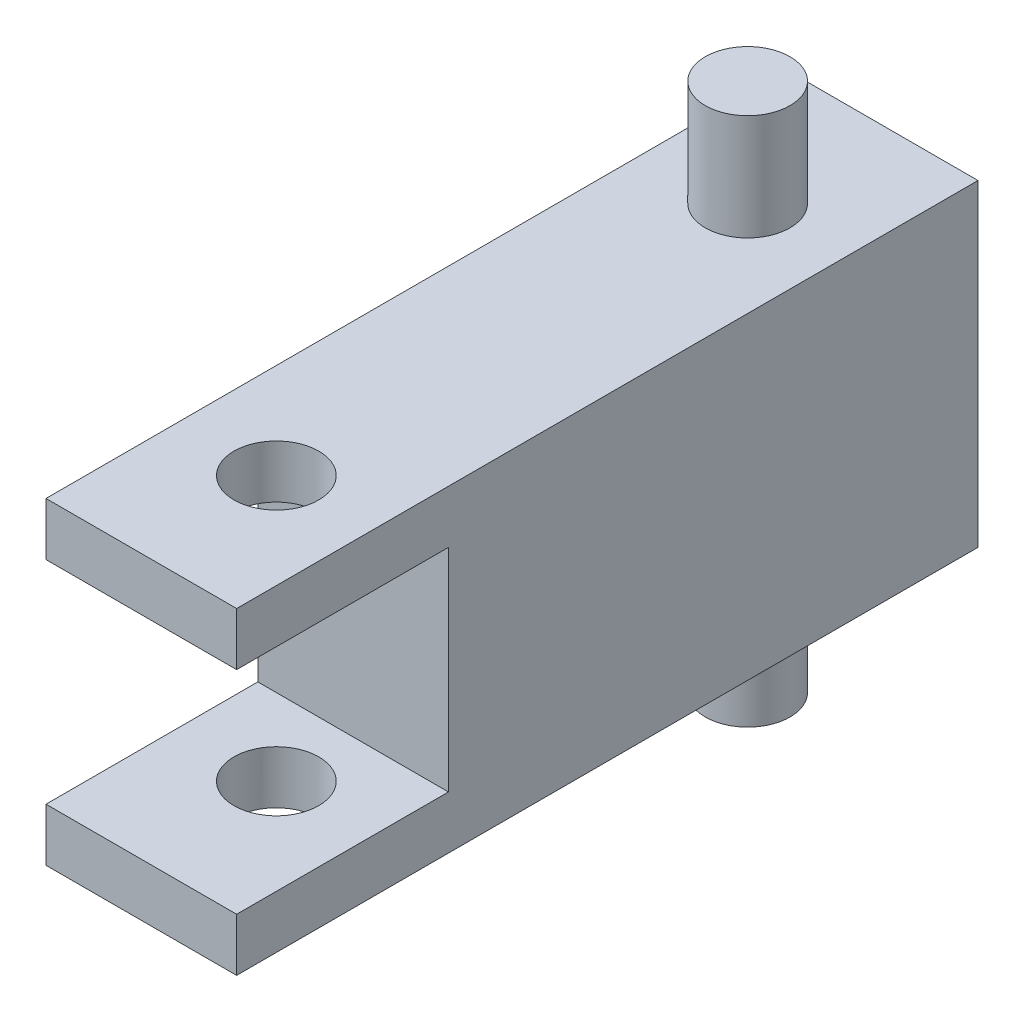
ISO-10303-21;
HEADER;
FILE_DESCRIPTION(('STEP AP214'),'2;1');
FILE_NAME('part.step','',(''),(''),'','','');
FILE_SCHEMA(('AUTOMOTIVE_DESIGN { 1 0 10303 214 1 1 1 1 }'));
ENDSEC;
DATA;
#1=APPLICATION_CONTEXT('core data for automotive mechanical design processes');
#2=APPLICATION_PROTOCOL_DEFINITION('international standard','automotive_design',2000,#1);
#3=PRODUCT_CONTEXT('',#1,'mechanical');
#4=PRODUCT('Part','Part','',(#3));
#5=PRODUCT_RELATED_PRODUCT_CATEGORY('part','',(#4));
#6=PRODUCT_DEFINITION_FORMATION('','',#4);
#7=PRODUCT_DEFINITION_CONTEXT('part definition',#1,'design');
#8=PRODUCT_DEFINITION('design','',#6,#7);
#9=PRODUCT_DEFINITION_SHAPE('','',#8);
#10=(LENGTH_UNIT() NAMED_UNIT(*) SI_UNIT(.MILLI.,.METRE.));
#11=(NAMED_UNIT(*) PLANE_ANGLE_UNIT() SI_UNIT($,.RADIAN.));
#12=(NAMED_UNIT(*) SI_UNIT($,.STERADIAN.) SOLID_ANGLE_UNIT());
#13=UNCERTAINTY_MEASURE_WITH_UNIT(LENGTH_MEASURE(1.E-05),#10,'distance_accuracy_value','');
#14=(GEOMETRIC_REPRESENTATION_CONTEXT(3) GLOBAL_UNCERTAINTY_ASSIGNED_CONTEXT((#13)) GLOBAL_UNIT_ASSIGNED_CONTEXT((#10,
#11,#12)) REPRESENTATION_CONTEXT('',''));
#15=CARTESIAN_POINT('',(0.,0.,0.));
#16=DIRECTION('',(0.,0.,1.));
#17=DIRECTION('',(1.,0.,0.));
#18=AXIS2_PLACEMENT_3D('',#15,#16,#17);
#19=CARTESIAN_POINT('',(0.,0.,70.));
#20=DIRECTION('',(0.,0.,1.));
#21=DIRECTION('',(1.,0.,0.));
#22=AXIS2_PLACEMENT_3D('',#19,#20,#21);
#23=PLANE('',#22);
#24=DIRECTION('',(1.,0.,0.));
#25=VECTOR('',#24,1.);
#26=CARTESIAN_POINT('',(-43.,9.99999999999999,70.));
#27=LINE('',#26,#25);
#28=CARTESIAN_POINT('',(-9.00000000000001,9.99999999999999,70.));
#29=VERTEX_POINT('',#28);
#30=CARTESIAN_POINT('',(9.,10.,70.));
#31=VERTEX_POINT('',#30);
#32=EDGE_CURVE('E163',#29,#31,#27,.T.);
#33=ORIENTED_EDGE('',*,*,#32,.T.);
#34=DIRECTION('',(0.,1.,0.));
#35=VECTOR('',#34,1.);
#36=CARTESIAN_POINT('',(9.,15.,70.));
#37=LINE('',#36,#35);
#38=CARTESIAN_POINT('',(9.,15.,70.));
#39=VERTEX_POINT('',#38);
#40=EDGE_CURVE('E90',#31,#39,#37,.T.);
#41=ORIENTED_EDGE('',*,*,#40,.T.);
#42=DIRECTION('',(-1.,0.,0.));
#43=VECTOR('',#42,1.);
#44=CARTESIAN_POINT('',(-9.,15.,70.));
#45=LINE('',#44,#43);
#46=CARTESIAN_POINT('',(-9.,15.,70.));
#47=VERTEX_POINT('',#46);
#48=EDGE_CURVE('E129',#39,#47,#45,.T.);
#49=ORIENTED_EDGE('',*,*,#48,.T.);
#50=DIRECTION('',(0.,-1.,0.));
#51=VECTOR('',#50,1.);
#52=CARTESIAN_POINT('',(-9.,15.,70.));
#53=LINE('',#52,#51);
#54=EDGE_CURVE('E137',#47,#29,#53,.T.);
#55=ORIENTED_EDGE('',*,*,#54,.T.);
#56=EDGE_LOOP('',(#33,#41,#49,#55));
#57=FACE_BOUND('',#56,.T.);
#58=ADVANCED_FACE('F37',(#57),#23,.T.);
#59=CARTESIAN_POINT('',(0.,-27.,57.25));
#60=DIRECTION('',(0.,1.,0.));
#61=DIRECTION('',(0.,0.,1.));
#62=AXIS2_PLACEMENT_3D('',#59,#60,#61);
#63=CYLINDRICAL_SURFACE('',#62,4.);
#64=CARTESIAN_POINT('',(0.,9.99999999999999,57.25));
#65=DIRECTION('',(0.,1.,0.));
#66=DIRECTION('',(0.,0.,1.));
#67=AXIS2_PLACEMENT_3D('',#64,#65,#66);
#68=CIRCLE('',#67,4.);
#69=CARTESIAN_POINT('',(0.,9.99999999999999,61.25));
#70=VERTEX_POINT('',#69);
#71=EDGE_CURVE('E164',#70,#70,#68,.F.);
#72=ORIENTED_EDGE('',*,*,#71,.T.);
#73=EDGE_LOOP('',(#72));
#74=FACE_BOUND('',#73,.T.);
#75=CARTESIAN_POINT('',(0.,15.,57.25));
#76=DIRECTION('',(0.,-1.,0.));
#77=DIRECTION('',(0.,0.,-1.));
#78=AXIS2_PLACEMENT_3D('',#75,#76,#77);
#79=CIRCLE('',#78,4.);
#80=CARTESIAN_POINT('',(0.,15.,53.25));
#81=VERTEX_POINT('',#80);
#82=EDGE_CURVE('E178',#81,#81,#79,.T.);
#83=ORIENTED_EDGE('',*,*,#82,.F.);
#84=EDGE_LOOP('',(#83));
#85=FACE_BOUND('',#84,.T.);
#86=ADVANCED_FACE('F206',(#74,#85),#63,.F.);
#87=CARTESIAN_POINT('',(9.,15.,70.));
#88=DIRECTION('',(-1.,0.,0.));
#89=DIRECTION('',(0.,-1.,0.));
#90=AXIS2_PLACEMENT_3D('',#87,#88,#89);
#91=PLANE('',#90);
#92=ORIENTED_EDGE('',*,*,#40,.F.);
#93=DIRECTION('',(0.,0.,1.));
#94=VECTOR('',#93,1.);
#95=CARTESIAN_POINT('',(9.,10.,50.));
#96=LINE('',#95,#94);
#97=CARTESIAN_POINT('',(9.,10.,50.));
#98=VERTEX_POINT('',#97);
#99=EDGE_CURVE('E119',#98,#31,#96,.T.);
#100=ORIENTED_EDGE('',*,*,#99,.F.);
#101=DIRECTION('',(0.,1.,0.));
#102=VECTOR('',#101,1.);
#103=CARTESIAN_POINT('',(9.,-9.99999999999999,50.));
#104=LINE('',#103,#102);
#105=CARTESIAN_POINT('',(9.,-9.99999999999999,50.));
#106=VERTEX_POINT('',#105);
#107=EDGE_CURVE('E126',#106,#98,#104,.T.);
#108=ORIENTED_EDGE('',*,*,#107,.F.);
#109=DIRECTION('',(0.,0.,-1.));
#110=VECTOR('',#109,1.);
#111=CARTESIAN_POINT('',(9.,-9.99999999999999,50.));
#112=LINE('',#111,#110);
#113=CARTESIAN_POINT('',(9.,-10.,70.));
#114=VERTEX_POINT('',#113);
#115=EDGE_CURVE('E115',#114,#106,#112,.T.);
#116=ORIENTED_EDGE('',*,*,#115,.F.);
#117=CARTESIAN_POINT('',(9.,-15.,70.));
#118=VERTEX_POINT('',#117);
#119=EDGE_CURVE('E123',#118,#114,#37,.T.);
#120=ORIENTED_EDGE('',*,*,#119,.F.);
#121=DIRECTION('',(0.,0.,-1.));
#122=VECTOR('',#121,1.);
#123=CARTESIAN_POINT('',(9.,-15.,70.));
#124=LINE('',#123,#122);
#125=CARTESIAN_POINT('',(9.,-15.,0.));
#126=VERTEX_POINT('',#125);
#127=EDGE_CURVE('E141',#118,#126,#124,.T.);
#128=ORIENTED_EDGE('',*,*,#127,.T.);
#129=DIRECTION('',(0.,1.,0.));
#130=VECTOR('',#129,1.);
#131=CARTESIAN_POINT('',(9.,15.,0.));
#132=LINE('',#131,#130);
#133=CARTESIAN_POINT('',(9.,15.,0.));
#134=VERTEX_POINT('',#133);
#135=EDGE_CURVE('E142',#126,#134,#132,.T.);
#136=ORIENTED_EDGE('',*,*,#135,.T.);
#137=DIRECTION('',(0.,0.,-1.));
#138=VECTOR('',#137,1.);
#139=CARTESIAN_POINT('',(9.,15.,70.));
#140=LINE('',#139,#138);
#141=EDGE_CURVE('E156',#39,#134,#140,.T.);
#142=ORIENTED_EDGE('',*,*,#141,.F.);
#143=EDGE_LOOP('',(#92,#100,#108,#116,#120,#128,#136,#142));
#144=FACE_BOUND('',#143,.T.);
#145=ADVANCED_FACE('F39',(#144),#91,.F.);
#146=CARTESIAN_POINT('',(-9.,15.,70.));
#147=DIRECTION('',(0.,-1.,0.));
#148=DIRECTION('',(0.,0.,-1.));
#149=AXIS2_PLACEMENT_3D('',#146,#147,#148);
#150=PLANE('',#149);
#151=ORIENTED_EDGE('',*,*,#82,.T.);
#152=EDGE_LOOP('',(#151));
#153=FACE_BOUND('',#152,.T.);
#154=CARTESIAN_POINT('',(0.,15.,12.75));
#155=DIRECTION('',(0.,-1.,0.));
#156=DIRECTION('',(0.,0.,-1.));
#157=AXIS2_PLACEMENT_3D('',#154,#155,#156);
#158=CIRCLE('',#157,4.);
#159=CARTESIAN_POINT('',(0.,15.,8.75));
#160=VERTEX_POINT('',#159);
#161=EDGE_CURVE('E45',#160,#160,#158,.F.);
#162=ORIENTED_EDGE('',*,*,#161,.F.);
#163=EDGE_LOOP('',(#162));
#164=FACE_BOUND('',#163,.T.);
#165=DIRECTION('',(-1.,0.,0.));
#166=VECTOR('',#165,1.);
#167=CARTESIAN_POINT('',(-9.,15.,0.));
#168=LINE('',#167,#166);
#169=CARTESIAN_POINT('',(-9.,15.,0.));
#170=VERTEX_POINT('',#169);
#171=EDGE_CURVE('E145',#134,#170,#168,.T.);
#172=ORIENTED_EDGE('',*,*,#171,.T.);
#173=DIRECTION('',(0.,0.,-1.));
#174=VECTOR('',#173,1.);
#175=CARTESIAN_POINT('',(-9.,15.,70.));
#176=LINE('',#175,#174);
#177=EDGE_CURVE('E153',#47,#170,#176,.T.);
#178=ORIENTED_EDGE('',*,*,#177,.F.);
#179=ORIENTED_EDGE('',*,*,#48,.F.);
#180=ORIENTED_EDGE('',*,*,#141,.T.);
#181=EDGE_LOOP('',(#172,#178,#179,#180));
#182=FACE_BOUND('',#181,.T.);
#183=ADVANCED_FACE('F227',(#153,#164,#182),#150,.F.);
#184=CARTESIAN_POINT('',(-9.,15.,70.));
#185=DIRECTION('',(1.,0.,0.));
#186=DIRECTION('',(0.,1.,0.));
#187=AXIS2_PLACEMENT_3D('',#184,#185,#186);
#188=PLANE('',#187);
#189=DIRECTION('',(0.,1.,0.));
#190=VECTOR('',#189,1.);
#191=CARTESIAN_POINT('',(-9.,15.,50.));
#192=LINE('',#191,#190);
#193=CARTESIAN_POINT('',(-9.00000000000001,-10.,50.));
#194=VERTEX_POINT('',#193);
#195=CARTESIAN_POINT('',(-9.00000000000001,10.,50.));
#196=VERTEX_POINT('',#195);
#197=EDGE_CURVE('E11',#194,#196,#192,.T.);
#198=ORIENTED_EDGE('',*,*,#197,.T.);
#199=DIRECTION('',(0.,0.,1.));
#200=VECTOR('',#199,1.);
#201=CARTESIAN_POINT('',(-9.,9.99999999999999,70.));
#202=LINE('',#201,#200);
#203=EDGE_CURVE('E166',#196,#29,#202,.T.);
#204=ORIENTED_EDGE('',*,*,#203,.T.);
#205=ORIENTED_EDGE('',*,*,#54,.F.);
#206=ORIENTED_EDGE('',*,*,#177,.T.);
#207=DIRECTION('',(0.,-1.,0.));
#208=VECTOR('',#207,1.);
#209=CARTESIAN_POINT('',(-9.,15.,0.));
#210=LINE('',#209,#208);
#211=CARTESIAN_POINT('',(-9.,-15.,0.));
#212=VERTEX_POINT('',#211);
#213=EDGE_CURVE('E147',#170,#212,#210,.T.);
#214=ORIENTED_EDGE('',*,*,#213,.T.);
#215=DIRECTION('',(0.,0.,-1.));
#216=VECTOR('',#215,1.);
#217=CARTESIAN_POINT('',(-9.,-15.,70.));
#218=LINE('',#217,#216);
#219=CARTESIAN_POINT('',(-9.,-15.,70.));
#220=VERTEX_POINT('',#219);
#221=EDGE_CURVE('E151',#220,#212,#218,.T.);
#222=ORIENTED_EDGE('',*,*,#221,.F.);
#223=CARTESIAN_POINT('',(-9.,-9.99999999999999,70.));
#224=VERTEX_POINT('',#223);
#225=EDGE_CURVE('E131',#224,#220,#53,.T.);
#226=ORIENTED_EDGE('',*,*,#225,.F.);
#227=DIRECTION('',(0.,0.,-1.));
#228=VECTOR('',#227,1.);
#229=CARTESIAN_POINT('',(-9.,-10.,70.));
#230=LINE('',#229,#228);
#231=EDGE_CURVE('E52',#224,#194,#230,.T.);
#232=ORIENTED_EDGE('',*,*,#231,.T.);
#233=EDGE_LOOP('',(#198,#204,#205,#206,#214,#222,#226,#232));
#234=FACE_BOUND('',#233,.T.);
#235=ADVANCED_FACE('F221',(#234),#188,.F.);
#236=CARTESIAN_POINT('',(-9.,-15.,70.));
#237=DIRECTION('',(0.,1.,0.));
#238=DIRECTION('',(0.,0.,1.));
#239=AXIS2_PLACEMENT_3D('',#236,#237,#238);
#240=PLANE('',#239);
#241=CARTESIAN_POINT('',(0.,-15.,57.25));
#242=DIRECTION('',(0.,1.,0.));
#243=DIRECTION('',(0.,0.,1.));
#244=AXIS2_PLACEMENT_3D('',#241,#242,#243);
#245=CIRCLE('',#244,4.);
#246=CARTESIAN_POINT('',(0.,-15.,61.25));
#247=VERTEX_POINT('',#246);
#248=EDGE_CURVE('E170',#247,#247,#245,.T.);
#249=ORIENTED_EDGE('',*,*,#248,.T.);
#250=EDGE_LOOP('',(#249));
#251=FACE_BOUND('',#250,.T.);
#252=CARTESIAN_POINT('',(0.,-15.,12.75));
#253=DIRECTION('',(0.,1.,0.));
#254=DIRECTION('',(0.,0.,1.));
#255=AXIS2_PLACEMENT_3D('',#252,#253,#254);
#256=CIRCLE('',#255,4.);
#257=CARTESIAN_POINT('',(0.,-15.,16.75));
#258=VERTEX_POINT('',#257);
#259=EDGE_CURVE('E181',#258,#258,#256,.T.);
#260=ORIENTED_EDGE('',*,*,#259,.T.);
#261=EDGE_LOOP('',(#260));
#262=FACE_BOUND('',#261,.T.);
#263=DIRECTION('',(1.,0.,0.));
#264=VECTOR('',#263,1.);
#265=CARTESIAN_POINT('',(-9.,-15.,0.));
#266=LINE('',#265,#264);
#267=EDGE_CURVE('E82',#212,#126,#266,.T.);
#268=ORIENTED_EDGE('',*,*,#267,.T.);
#269=ORIENTED_EDGE('',*,*,#127,.F.);
#270=DIRECTION('',(1.,0.,0.));
#271=VECTOR('',#270,1.);
#272=CARTESIAN_POINT('',(-9.,-15.,70.));
#273=LINE('',#272,#271);
#274=EDGE_CURVE('E61',#220,#118,#273,.T.);
#275=ORIENTED_EDGE('',*,*,#274,.F.);
#276=ORIENTED_EDGE('',*,*,#221,.T.);
#277=EDGE_LOOP('',(#268,#269,#275,#276));
#278=FACE_BOUND('',#277,.T.);
#279=ADVANCED_FACE('F187',(#251,#262,#278),#240,.F.);
#280=DIRECTION('',(1.,0.,0.));
#281=VECTOR('',#280,1.);
#282=CARTESIAN_POINT('',(-43.,-10.,70.));
#283=LINE('',#282,#281);
#284=EDGE_CURVE('E112',#224,#114,#283,.T.);
#285=ORIENTED_EDGE('',*,*,#284,.F.);
#286=ORIENTED_EDGE('',*,*,#225,.T.);
#287=ORIENTED_EDGE('',*,*,#274,.T.);
#288=ORIENTED_EDGE('',*,*,#119,.T.);
#289=EDGE_LOOP('',(#285,#286,#287,#288));
#290=FACE_BOUND('',#289,.T.);
#291=ADVANCED_FACE('F128',(#290),#23,.T.);
#292=CARTESIAN_POINT('',(0.,0.,0.));
#293=DIRECTION('',(0.,0.,1.));
#294=DIRECTION('',(1.,0.,0.));
#295=AXIS2_PLACEMENT_3D('',#292,#293,#294);
#296=PLANE('',#295);
#297=ORIENTED_EDGE('',*,*,#135,.F.);
#298=ORIENTED_EDGE('',*,*,#267,.F.);
#299=ORIENTED_EDGE('',*,*,#213,.F.);
#300=ORIENTED_EDGE('',*,*,#171,.F.);
#301=EDGE_LOOP('',(#297,#298,#299,#300));
#302=FACE_BOUND('',#301,.T.);
#303=ADVANCED_FACE('F215',(#302),#296,.F.);
#304=CARTESIAN_POINT('',(0.,25.,12.75));
#305=DIRECTION('',(0.,-1.,0.));
#306=DIRECTION('',(0.,0.,-1.));
#307=AXIS2_PLACEMENT_3D('',#304,#305,#306);
#308=CYLINDRICAL_SURFACE('',#307,4.);
#309=CARTESIAN_POINT('',(0.,25.,12.75));
#310=DIRECTION('',(0.,1.,0.));
#311=DIRECTION('',(0.,0.,1.));
#312=AXIS2_PLACEMENT_3D('',#309,#310,#311);
#313=CIRCLE('',#312,4.);
#314=CARTESIAN_POINT('',(0.,25.,16.75));
#315=VERTEX_POINT('',#314);
#316=EDGE_CURVE('E134',#315,#315,#313,.T.);
#317=ORIENTED_EDGE('',*,*,#316,.F.);
#318=EDGE_LOOP('',(#317));
#319=FACE_BOUND('',#318,.T.);
#320=ORIENTED_EDGE('',*,*,#161,.T.);
#321=EDGE_LOOP('',(#320));
#322=FACE_BOUND('',#321,.T.);
#323=ADVANCED_FACE('F202',(#319,#322),#308,.T.);
#324=CARTESIAN_POINT('',(0.,25.,12.75));
#325=DIRECTION('',(0.,1.,0.));
#326=DIRECTION('',(0.,0.,1.));
#327=AXIS2_PLACEMENT_3D('',#324,#325,#326);
#328=PLANE('',#327);
#329=ORIENTED_EDGE('',*,*,#316,.T.);
#330=EDGE_LOOP('',(#329));
#331=FACE_BOUND('',#330,.T.);
#332=ADVANCED_FACE('F192',(#331),#328,.T.);
#333=CARTESIAN_POINT('',(0.,-25.,12.75));
#334=DIRECTION('',(0.,1.,0.));
#335=DIRECTION('',(0.,0.,1.));
#336=AXIS2_PLACEMENT_3D('',#333,#334,#335);
#337=CYLINDRICAL_SURFACE('',#336,4.);
#338=CARTESIAN_POINT('',(0.,-25.,12.75));
#339=DIRECTION('',(0.,1.,0.));
#340=DIRECTION('',(0.,0.,1.));
#341=AXIS2_PLACEMENT_3D('',#338,#339,#340);
#342=CIRCLE('',#341,4.);
#343=CARTESIAN_POINT('',(0.,-25.,16.75));
#344=VERTEX_POINT('',#343);
#345=EDGE_CURVE('E182',#344,#344,#342,.T.);
#346=ORIENTED_EDGE('',*,*,#345,.T.);
#347=EDGE_LOOP('',(#346));
#348=FACE_BOUND('',#347,.T.);
#349=ORIENTED_EDGE('',*,*,#259,.F.);
#350=EDGE_LOOP('',(#349));
#351=FACE_BOUND('',#350,.T.);
#352=ADVANCED_FACE('F189',(#348,#351),#337,.T.);
#353=CARTESIAN_POINT('',(0.,-25.,12.75));
#354=DIRECTION('',(0.,-1.,0.));
#355=DIRECTION('',(0.,0.,1.));
#356=AXIS2_PLACEMENT_3D('',#353,#354,#355);
#357=PLANE('',#356);
#358=ORIENTED_EDGE('',*,*,#345,.F.);
#359=EDGE_LOOP('',(#358));
#360=FACE_BOUND('',#359,.T.);
#361=ADVANCED_FACE('F191',(#360),#357,.T.);
#362=CARTESIAN_POINT('',(0.,-10.,57.25));
#363=DIRECTION('',(0.,-1.,0.));
#364=DIRECTION('',(1.,0.,0.));
#365=AXIS2_PLACEMENT_3D('',#362,#363,#364);
#366=CIRCLE('',#365,4.);
#367=CARTESIAN_POINT('',(4.00000000000001,-10.,57.25));
#368=VERTEX_POINT('',#367);
#369=EDGE_CURVE('E161',#368,#368,#366,.F.);
#370=ORIENTED_EDGE('',*,*,#369,.T.);
#371=EDGE_LOOP('',(#370));
#372=FACE_BOUND('',#371,.T.);
#373=ORIENTED_EDGE('',*,*,#248,.F.);
#374=EDGE_LOOP('',(#373));
#375=FACE_BOUND('',#374,.T.);
#376=ADVANCED_FACE('F199',(#372,#375),#63,.F.);
#377=CARTESIAN_POINT('',(-43.,-10.,50.));
#378=DIRECTION('',(0.,0.,-1.));
#379=DIRECTION('',(0.,1.,0.));
#380=AXIS2_PLACEMENT_3D('',#377,#378,#379);
#381=PLANE('',#380);
#382=DIRECTION('',(1.,0.,0.));
#383=VECTOR('',#382,1.);
#384=CARTESIAN_POINT('',(-43.,-10.,50.));
#385=LINE('',#384,#383);
#386=EDGE_CURVE('E118',#194,#106,#385,.T.);
#387=ORIENTED_EDGE('',*,*,#386,.T.);
#388=ORIENTED_EDGE('',*,*,#107,.T.);
#389=DIRECTION('',(1.,0.,0.));
#390=VECTOR('',#389,1.);
#391=CARTESIAN_POINT('',(-43.,9.99999999999999,50.));
#392=LINE('',#391,#390);
#393=EDGE_CURVE('E249',#196,#98,#392,.T.);
#394=ORIENTED_EDGE('',*,*,#393,.F.);
#395=ORIENTED_EDGE('',*,*,#197,.F.);
#396=EDGE_LOOP('',(#387,#388,#394,#395));
#397=FACE_BOUND('',#396,.T.);
#398=ADVANCED_FACE('F251',(#397),#381,.F.);
#399=CARTESIAN_POINT('',(-43.,9.99999999999999,50.));
#400=DIRECTION('',(0.,1.,0.));
#401=DIRECTION('',(0.,0.,1.));
#402=AXIS2_PLACEMENT_3D('',#399,#400,#401);
#403=PLANE('',#402);
#404=ORIENTED_EDGE('',*,*,#71,.F.);
#405=EDGE_LOOP('',(#404));
#406=FACE_BOUND('',#405,.T.);
#407=ORIENTED_EDGE('',*,*,#393,.T.);
#408=ORIENTED_EDGE('',*,*,#99,.T.);
#409=ORIENTED_EDGE('',*,*,#32,.F.);
#410=ORIENTED_EDGE('',*,*,#203,.F.);
#411=EDGE_LOOP('',(#407,#408,#409,#410));
#412=FACE_BOUND('',#411,.T.);
#413=ADVANCED_FACE('F253',(#406,#412),#403,.F.);
#414=CARTESIAN_POINT('',(-43.,-10.,50.));
#415=DIRECTION('',(0.,-1.,0.));
#416=DIRECTION('',(1.,0.,0.));
#417=AXIS2_PLACEMENT_3D('',#414,#415,#416);
#418=PLANE('',#417);
#419=ORIENTED_EDGE('',*,*,#369,.F.);
#420=EDGE_LOOP('',(#419));
#421=FACE_BOUND('',#420,.T.);
#422=ORIENTED_EDGE('',*,*,#284,.T.);
#423=ORIENTED_EDGE('',*,*,#115,.T.);
#424=ORIENTED_EDGE('',*,*,#386,.F.);
#425=ORIENTED_EDGE('',*,*,#231,.F.);
#426=EDGE_LOOP('',(#422,#423,#424,#425));
#427=FACE_BOUND('',#426,.T.);
#428=ADVANCED_FACE('F114',(#421,#427),#418,.F.);
#429=CLOSED_SHELL('',(#58,#86,#145,#183,#235,#279,#291,#303,#323,#332,#352,#361,#376,#398,#413,#428));
#430=MANIFOLD_SOLID_BREP('B2',#429);
#431=ADVANCED_BREP_SHAPE_REPRESENTATION('',(#18,#430),#14);
#432=SHAPE_DEFINITION_REPRESENTATION(#9,#431);
ENDSEC;
END-ISO-10303-21;
